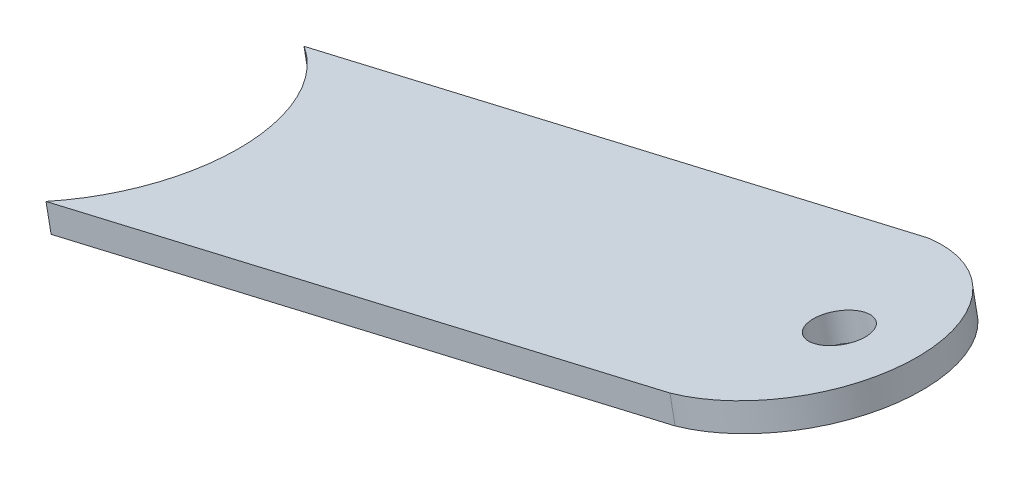
ISO-10303-21;
HEADER;
FILE_DESCRIPTION(('STEP AP214'),'2;1');
FILE_NAME('part.step','',(''),(''),'','','');
FILE_SCHEMA(('AUTOMOTIVE_DESIGN { 1 0 10303 214 1 1 1 1 }'));
ENDSEC;
DATA;
#1=APPLICATION_CONTEXT('core data for automotive mechanical design processes');
#2=APPLICATION_PROTOCOL_DEFINITION('international standard','automotive_design',2000,#1);
#3=PRODUCT_CONTEXT('',#1,'mechanical');
#4=PRODUCT('Part','Part','',(#3));
#5=PRODUCT_RELATED_PRODUCT_CATEGORY('part','',(#4));
#6=PRODUCT_DEFINITION_FORMATION('','',#4);
#7=PRODUCT_DEFINITION_CONTEXT('part definition',#1,'design');
#8=PRODUCT_DEFINITION('design','',#6,#7);
#9=PRODUCT_DEFINITION_SHAPE('','',#8);
#10=(LENGTH_UNIT() NAMED_UNIT(*) SI_UNIT(.MILLI.,.METRE.));
#11=(NAMED_UNIT(*) PLANE_ANGLE_UNIT() SI_UNIT($,.RADIAN.));
#12=(NAMED_UNIT(*) SI_UNIT($,.STERADIAN.) SOLID_ANGLE_UNIT());
#13=UNCERTAINTY_MEASURE_WITH_UNIT(LENGTH_MEASURE(1.E-05),#10,'distance_accuracy_value','');
#14=(GEOMETRIC_REPRESENTATION_CONTEXT(3) GLOBAL_UNCERTAINTY_ASSIGNED_CONTEXT((#13)) GLOBAL_UNIT_ASSIGNED_CONTEXT((#10,
#11,#12)) REPRESENTATION_CONTEXT('',''));
#15=CARTESIAN_POINT('',(0.,0.,0.));
#16=DIRECTION('',(0.,0.,1.));
#17=DIRECTION('',(1.,0.,0.));
#18=AXIS2_PLACEMENT_3D('',#15,#16,#17);
#19=CARTESIAN_POINT('',(917.303712479927,-302.19596538052,592.22657392993));
#20=CARTESIAN_POINT('',(1058.24265332336,-274.58797589045,622.199432067129));
#21=CARTESIAN_POINT('',(1018.43912019593,-282.384937593677,488.850736669417));
#22=CARTESIAN_POINT('',(912.307050962627,-303.174742273758,570.07336242027));
#23=(BOUNDED_CURVE() B_SPLINE_CURVE(3,(#19,#20,#21,#22),.UNSPECIFIED.,.F.,
.F.) B_SPLINE_CURVE_WITH_KNOTS((4,4),(-1.45563912941593,2.47269988309875),
.UNSPECIFIED.) CURVE() GEOMETRIC_REPRESENTATION_ITEM() RATIONAL_B_SPLINE_CURVE((2.95017647068925,
0.15594702474745,0.168135280646364,2.98674123838599)) REPRESENTATION_ITEM(''));
#24=DIRECTION('',(0.192232768347809,-0.981349358166264,0.));
#25=VECTOR('',#24,1.);
#26=SURFACE_OF_LINEAR_EXTRUSION('',#23,#25);
#27=DIRECTION('',(0.192232768347809,-0.981349358166264,0.));
#28=VECTOR('',#27,1.);
#29=CARTESIAN_POINT('',(927.14613441403,-300.267971032844,569.811781148016));
#30=LINE('',#29,#28);
#31=CARTESIAN_POINT('',(927.14613441403,-300.267971032844,569.811781148016));
#32=VERTEX_POINT('',#31);
#33=CARTESIAN_POINT('',(927.530599950726,-302.230669749177,569.811781148016));
#34=VERTEX_POINT('',#33);
#35=EDGE_CURVE('E40',#32,#34,#30,.T.);
#36=ORIENTED_EDGE('',*,*,#35,.T.);
#37=CARTESIAN_POINT('',(917.688178016623,-304.158664096852,592.22657392993));
#38=CARTESIAN_POINT('',(1058.62711886006,-276.550674606782,622.199432067129));
#39=CARTESIAN_POINT('',(1018.82358573263,-284.34763631001,488.850736669417));
#40=CARTESIAN_POINT('',(912.691516499323,-305.137440990091,570.07336242027));
#41=(BOUNDED_CURVE() B_SPLINE_CURVE(3,(#37,#38,#39,#40),.UNSPECIFIED.,.F.,
.F.) B_SPLINE_CURVE_WITH_KNOTS((4,4),(-1.45563912941593,2.47269988309875),
.UNSPECIFIED.) CURVE() GEOMETRIC_REPRESENTATION_ITEM() RATIONAL_B_SPLINE_CURVE((2.95017647068925,
0.15594702474745,0.168135280646364,2.98674123838599)) REPRESENTATION_ITEM(''));
#42=CARTESIAN_POINT('',(928.034488815876,-302.131964888689,589.810571864873));
#43=VERTEX_POINT('',#42);
#44=EDGE_CURVE('E77',#43,#34,#41,.T.);
#45=ORIENTED_EDGE('',*,*,#44,.F.);
#46=DIRECTION('',(0.192232768347809,-0.981349358166264,0.));
#47=VECTOR('',#46,1.);
#48=CARTESIAN_POINT('',(927.650023279181,-300.169266172356,589.810571864873));
#49=LINE('',#48,#47);
#50=CARTESIAN_POINT('',(927.650023279181,-300.169266172356,589.810571864873));
#51=VERTEX_POINT('',#50);
#52=EDGE_CURVE('E11',#51,#43,#49,.T.);
#53=ORIENTED_EDGE('',*,*,#52,.F.);
#54=EDGE_CURVE('E78',#51,#32,#23,.T.);
#55=ORIENTED_EDGE('',*,*,#54,.T.);
#56=EDGE_LOOP('',(#36,#45,#53,#55));
#57=FACE_BOUND('',#56,.T.);
#58=ADVANCED_FACE('F36',(#57),#26,.T.);
#59=CARTESIAN_POINT('',(927.650023279181,-300.169266172356,589.810571864873));
#60=DIRECTION('',(0.0479335578120103,0.00938952111017875,0.998806393115705));
#61=DIRECTION('',(0.998850424964509,0.,-0.0479356709374216));
#62=AXIS2_PLACEMENT_3D('',#59,#60,#61);
#63=PLANE('',#62);
#64=ORIENTED_EDGE('',*,*,#52,.T.);
#65=DIRECTION('',(-0.980178012816458,-0.192003317992122,0.0488445398299117));
#66=VECTOR('',#65,1.);
#67=CARTESIAN_POINT('',(928.034488815876,-302.131964888689,589.810571864873));
#68=LINE('',#67,#66);
#69=CARTESIAN_POINT('',(972.9472018765,-293.334185490547,587.57246738459));
#70=VERTEX_POINT('',#69);
#71=EDGE_CURVE('E94',#70,#43,#68,.T.);
#72=ORIENTED_EDGE('',*,*,#71,.F.);
#73=DIRECTION('',(0.192232768347809,-0.981349358166264,0.));
#74=VECTOR('',#73,1.);
#75=CARTESIAN_POINT('',(972.562736339804,-291.371486774215,587.57246738459));
#76=LINE('',#75,#74);
#77=CARTESIAN_POINT('',(972.562736339804,-291.371486774215,587.57246738459));
#78=VERTEX_POINT('',#77);
#79=EDGE_CURVE('E45',#78,#70,#76,.T.);
#80=ORIENTED_EDGE('',*,*,#79,.F.);
#81=DIRECTION('',(-0.980178012816458,-0.192003317992122,0.0488445398299117));
#82=VECTOR('',#81,1.);
#83=CARTESIAN_POINT('',(927.650023279181,-300.169266172356,589.810571864873));
#84=LINE('',#83,#82);
#85=EDGE_CURVE('E83',#78,#51,#84,.T.);
#86=ORIENTED_EDGE('',*,*,#85,.T.);
#87=EDGE_LOOP('',(#64,#72,#80,#86));
#88=FACE_BOUND('',#87,.T.);
#89=ADVANCED_FACE('F124',(#88),#63,.T.);
#90=CARTESIAN_POINT('',(971.407646481582,-291.597752903895,577.596700813137));
#91=DIRECTION('',(0.192232768347809,-0.981349358166264,0.));
#92=DIRECTION('',(0.981349358166264,0.192232768347809,0.));
#93=AXIS2_PLACEMENT_3D('',#90,#91,#92);
#94=CYLINDRICAL_SURFACE('',#93,10.0449662831755);
#95=ORIENTED_EDGE('',*,*,#79,.T.);
#96=CARTESIAN_POINT('',(971.792112018278,-293.560451620228,577.596700813137));
#97=DIRECTION('',(0.192232768347809,-0.981349358166264,0.));
#98=DIRECTION('',(-0.981349358166264,-0.192232768347809,0.));
#99=AXIS2_PLACEMENT_3D('',#96,#97,#98);
#100=CIRCLE('',#99,10.0449662831755);
#101=CARTESIAN_POINT('',(972.44331301135,-293.432890351035,567.573676667733));
#102=VERTEX_POINT('',#101);
#103=EDGE_CURVE('E90',#102,#70,#100,.T.);
#104=ORIENTED_EDGE('',*,*,#103,.F.);
#105=DIRECTION('',(0.192232768347809,-0.981349358166264,0.));
#106=VECTOR('',#105,1.);
#107=CARTESIAN_POINT('',(972.058847474654,-291.470191634703,567.573676667733));
#108=LINE('',#107,#106);
#109=CARTESIAN_POINT('',(972.058847474654,-291.470191634703,567.573676667733));
#110=VERTEX_POINT('',#109);
#111=EDGE_CURVE('E82',#110,#102,#108,.T.);
#112=ORIENTED_EDGE('',*,*,#111,.F.);
#113=CARTESIAN_POINT('',(971.407646481582,-291.597752903895,577.596700813137));
#114=DIRECTION('',(0.192232768347809,-0.981349358166264,0.));
#115=DIRECTION('',(-0.981349358166264,-0.192232768347809,0.));
#116=AXIS2_PLACEMENT_3D('',#113,#114,#115);
#117=CIRCLE('',#116,10.0449662831755);
#118=EDGE_CURVE('E117',#110,#78,#117,.T.);
#119=ORIENTED_EDGE('',*,*,#118,.T.);
#120=EDGE_LOOP('',(#95,#104,#112,#119));
#121=FACE_BOUND('',#120,.T.);
#122=ADVANCED_FACE('F121',(#121),#94,.T.);
#123=CARTESIAN_POINT('',(927.14613441403,-300.267971032844,569.811781148016));
#124=DIRECTION('',(-0.0479335578120128,-0.00938952111017924,-0.998806393115705));
#125=DIRECTION('',(-0.998850424964508,0.,0.0479356709374241));
#126=AXIS2_PLACEMENT_3D('',#123,#124,#125);
#127=PLANE('',#126);
#128=ORIENTED_EDGE('',*,*,#111,.T.);
#129=DIRECTION('',(0.980178012816458,0.192003317992122,-0.0488445398299142));
#130=VECTOR('',#129,1.);
#131=CARTESIAN_POINT('',(927.530599950726,-302.230669749177,569.811781148016));
#132=LINE('',#131,#130);
#133=EDGE_CURVE('E85',#34,#102,#132,.T.);
#134=ORIENTED_EDGE('',*,*,#133,.F.);
#135=ORIENTED_EDGE('',*,*,#35,.F.);
#136=DIRECTION('',(0.980178012816458,0.192003317992122,-0.0488445398299142));
#137=VECTOR('',#136,1.);
#138=CARTESIAN_POINT('',(927.14613441403,-300.267971032844,569.811781148016));
#139=LINE('',#138,#137);
#140=EDGE_CURVE('E112',#32,#110,#139,.T.);
#141=ORIENTED_EDGE('',*,*,#140,.T.);
#142=EDGE_LOOP('',(#128,#134,#135,#141));
#143=FACE_BOUND('',#142,.T.);
#144=ADVANCED_FACE('F86',(#143),#127,.T.);
#145=CARTESIAN_POINT('',(932.070560064464,-299.303344146987,577.132599749912));
#146=DIRECTION('',(0.192232768347809,-0.981349358166264,0.));
#147=DIRECTION('',(0.981349358166264,0.192232768347809,0.));
#148=AXIS2_PLACEMENT_3D('',#145,#146,#147);
#149=PLANE('',#148);
#150=CARTESIAN_POINT('',(975.217352006472,-290.851484275353,577.428231406724));
#151=DIRECTION('',(0.192232768347809,-0.981349358166264,0.));
#152=DIRECTION('',(0.981349358166264,0.192232768347809,0.));
#153=AXIS2_PLACEMENT_3D('',#150,#151,#152);
#154=CIRCLE('',#153,1.99999999999988);
#155=CARTESIAN_POINT('',(977.180050722805,-290.467018738657,577.428231406724));
#156=VERTEX_POINT('',#155);
#157=EDGE_CURVE('E95',#156,#156,#154,.T.);
#158=ORIENTED_EDGE('',*,*,#157,.T.);
#159=EDGE_LOOP('',(#158));
#160=FACE_BOUND('',#159,.T.);
#161=ORIENTED_EDGE('',*,*,#54,.F.);
#162=ORIENTED_EDGE('',*,*,#85,.F.);
#163=ORIENTED_EDGE('',*,*,#118,.F.);
#164=ORIENTED_EDGE('',*,*,#140,.F.);
#165=EDGE_LOOP('',(#161,#162,#163,#164));
#166=FACE_BOUND('',#165,.T.);
#167=ADVANCED_FACE('F126',(#160,#166),#149,.F.);
#168=CARTESIAN_POINT('',(932.45502560116,-301.266042863319,577.132599749912));
#169=DIRECTION('',(0.192232768347809,-0.981349358166264,0.));
#170=DIRECTION('',(0.981349358166264,0.192232768347809,0.));
#171=AXIS2_PLACEMENT_3D('',#168,#169,#170);
#172=PLANE('',#171);
#173=CARTESIAN_POINT('',(975.601817543167,-292.814182991682,577.428231406724));
#174=DIRECTION('',(0.192232768347814,-0.981349358166263,0.));
#175=DIRECTION('',(0.981349358166263,0.192232768347814,0.));
#176=AXIS2_PLACEMENT_3D('',#173,#174,#175);
#177=CIRCLE('',#176,1.99999999999988);
#178=CARTESIAN_POINT('',(977.564516259499,-292.429717454986,577.428231406724));
#179=VERTEX_POINT('',#178);
#180=EDGE_CURVE('E98',#179,#179,#177,.T.);
#181=ORIENTED_EDGE('',*,*,#180,.F.);
#182=EDGE_LOOP('',(#181));
#183=FACE_BOUND('',#182,.T.);
#184=ORIENTED_EDGE('',*,*,#44,.T.);
#185=ORIENTED_EDGE('',*,*,#133,.T.);
#186=ORIENTED_EDGE('',*,*,#103,.T.);
#187=ORIENTED_EDGE('',*,*,#71,.T.);
#188=EDGE_LOOP('',(#184,#185,#186,#187));
#189=FACE_BOUND('',#188,.T.);
#190=ADVANCED_FACE('F93',(#183,#189),#172,.T.);
#191=CARTESIAN_POINT('',(973.217464011962,-280.642044871835,577.428231406724));
#192=DIRECTION('',(0.192232768347814,-0.981349358166263,0.));
#193=DIRECTION('',(0.981349358166263,0.192232768347814,0.));
#194=AXIS2_PLACEMENT_3D('',#191,#192,#193);
#195=CYLINDRICAL_SURFACE('',#194,1.99999999999988);
#196=ORIENTED_EDGE('',*,*,#180,.T.);
#197=EDGE_LOOP('',(#196));
#198=FACE_BOUND('',#197,.T.);
#199=ORIENTED_EDGE('',*,*,#157,.F.);
#200=EDGE_LOOP('',(#199));
#201=FACE_BOUND('',#200,.T.);
#202=ADVANCED_FACE('F134',(#198,#201),#195,.F.);
#203=CLOSED_SHELL('',(#58,#89,#122,#144,#167,#190,#202));
#204=MANIFOLD_SOLID_BREP('B2',#203);
#205=ADVANCED_BREP_SHAPE_REPRESENTATION('',(#18,#204),#14);
#206=SHAPE_DEFINITION_REPRESENTATION(#9,#205);
ENDSEC;
END-ISO-10303-21;
